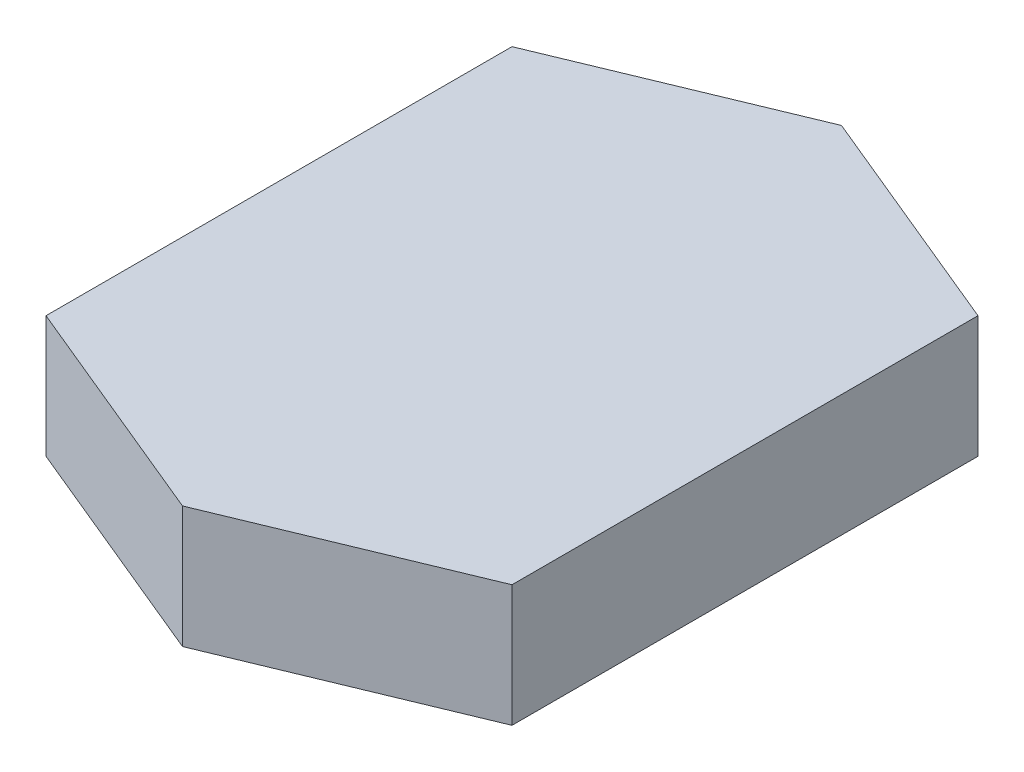
ISO-10303-21;
HEADER;
FILE_DESCRIPTION(('STEP AP214'),'2;1');
FILE_NAME('part.step','',(''),(''),'','','');
FILE_SCHEMA(('AUTOMOTIVE_DESIGN { 1 0 10303 214 1 1 1 1 }'));
ENDSEC;
DATA;
#1=APPLICATION_CONTEXT('core data for automotive mechanical design processes');
#2=APPLICATION_PROTOCOL_DEFINITION('international standard','automotive_design',2000,#1);
#3=PRODUCT_CONTEXT('',#1,'mechanical');
#4=PRODUCT('Part','Part','',(#3));
#5=PRODUCT_RELATED_PRODUCT_CATEGORY('part','',(#4));
#6=PRODUCT_DEFINITION_FORMATION('','',#4);
#7=PRODUCT_DEFINITION_CONTEXT('part definition',#1,'design');
#8=PRODUCT_DEFINITION('design','',#6,#7);
#9=PRODUCT_DEFINITION_SHAPE('','',#8);
#10=(LENGTH_UNIT() NAMED_UNIT(*) SI_UNIT(.MILLI.,.METRE.));
#11=(NAMED_UNIT(*) PLANE_ANGLE_UNIT() SI_UNIT($,.RADIAN.));
#12=(NAMED_UNIT(*) SI_UNIT($,.STERADIAN.) SOLID_ANGLE_UNIT());
#13=UNCERTAINTY_MEASURE_WITH_UNIT(LENGTH_MEASURE(1.E-05),#10,'distance_accuracy_value','');
#14=(GEOMETRIC_REPRESENTATION_CONTEXT(3) GLOBAL_UNCERTAINTY_ASSIGNED_CONTEXT((#13)) GLOBAL_UNIT_ASSIGNED_CONTEXT((#10,
#11,#12)) REPRESENTATION_CONTEXT('',''));
#15=CARTESIAN_POINT('',(0.,0.,0.));
#16=DIRECTION('',(0.,0.,1.));
#17=DIRECTION('',(1.,0.,0.));
#18=AXIS2_PLACEMENT_3D('',#15,#16,#17);
#19=CARTESIAN_POINT('',(-19.1341716182545,10.,-19.1341716182545));
#20=DIRECTION('',(0.382683432365091,0.,0.923879532511287));
#21=DIRECTION('',(0.923879532511287,0.,-0.382683432365091));
#22=AXIS2_PLACEMENT_3D('',#19,#20,#21);
#23=PLANE('',#22);
#24=DIRECTION('',(-0.923879532511287,0.,0.382683432365091));
#25=VECTOR('',#24,1.);
#26=CARTESIAN_POINT('',(-19.1341716182545,0.,-19.1341716182545));
#27=LINE('',#26,#25);
#28=CARTESIAN_POINT('',(0.,0.,-27.0598050073099));
#29=VERTEX_POINT('',#28);
#30=CARTESIAN_POINT('',(-19.1341716182545,0.,-19.1341716182545));
#31=VERTEX_POINT('',#30);
#32=EDGE_CURVE('E135',#29,#31,#27,.T.);
#33=ORIENTED_EDGE('',*,*,#32,.T.);
#34=DIRECTION('',(0.,-1.,0.));
#35=VECTOR('',#34,1.);
#36=CARTESIAN_POINT('',(-19.1341716182545,10.,-19.1341716182545));
#37=LINE('',#36,#35);
#38=CARTESIAN_POINT('',(-19.1341716182545,10.,-19.1341716182545));
#39=VERTEX_POINT('',#38);
#40=EDGE_CURVE('E12',#39,#31,#37,.T.);
#41=ORIENTED_EDGE('',*,*,#40,.F.);
#42=DIRECTION('',(-0.923879532511287,0.,0.382683432365091));
#43=VECTOR('',#42,1.);
#44=CARTESIAN_POINT('',(-19.1341716182545,10.,-19.1341716182545));
#45=LINE('',#44,#43);
#46=CARTESIAN_POINT('',(0.,10.,-27.0598050073099));
#47=VERTEX_POINT('',#46);
#48=EDGE_CURVE('E145',#47,#39,#45,.T.);
#49=ORIENTED_EDGE('',*,*,#48,.F.);
#50=DIRECTION('',(0.,-1.,0.));
#51=VECTOR('',#50,1.);
#52=CARTESIAN_POINT('',(0.,10.,-27.0598050073099));
#53=LINE('',#52,#51);
#54=EDGE_CURVE('E131',#47,#29,#53,.T.);
#55=ORIENTED_EDGE('',*,*,#54,.T.);
#56=EDGE_LOOP('',(#33,#41,#49,#55));
#57=FACE_BOUND('',#56,.T.);
#58=ADVANCED_FACE('F51',(#57),#23,.F.);
#59=CARTESIAN_POINT('',(-19.1341716182544,10.,19.1341716182545));
#60=DIRECTION('',(1.,0.,0.));
#61=DIRECTION('',(0.,0.,-1.));
#62=AXIS2_PLACEMENT_3D('',#59,#60,#61);
#63=PLANE('',#62);
#64=DIRECTION('',(0.,0.,1.));
#65=VECTOR('',#64,1.);
#66=CARTESIAN_POINT('',(-19.1341716182544,0.,19.1341716182545));
#67=LINE('',#66,#65);
#68=CARTESIAN_POINT('',(-19.1341716182544,0.,19.1341716182545));
#69=VERTEX_POINT('',#68);
#70=EDGE_CURVE('E138',#31,#69,#67,.T.);
#71=ORIENTED_EDGE('',*,*,#70,.T.);
#72=DIRECTION('',(0.,-1.,0.));
#73=VECTOR('',#72,1.);
#74=CARTESIAN_POINT('',(-19.1341716182544,10.,19.1341716182545));
#75=LINE('',#74,#73);
#76=CARTESIAN_POINT('',(-19.1341716182544,10.,19.1341716182545));
#77=VERTEX_POINT('',#76);
#78=EDGE_CURVE('E59',#77,#69,#75,.T.);
#79=ORIENTED_EDGE('',*,*,#78,.F.);
#80=DIRECTION('',(0.,0.,1.));
#81=VECTOR('',#80,1.);
#82=CARTESIAN_POINT('',(-19.1341716182544,10.,19.1341716182545));
#83=LINE('',#82,#81);
#84=EDGE_CURVE('E104',#39,#77,#83,.T.);
#85=ORIENTED_EDGE('',*,*,#84,.F.);
#86=ORIENTED_EDGE('',*,*,#40,.T.);
#87=EDGE_LOOP('',(#71,#79,#85,#86));
#88=FACE_BOUND('',#87,.T.);
#89=ADVANCED_FACE('F169',(#88),#63,.F.);
#90=CARTESIAN_POINT('',(0.,10.,27.0598050073098));
#91=DIRECTION('',(0.382683432365089,0.,-0.923879532511287));
#92=DIRECTION('',(-0.923879532511287,0.,-0.382683432365089));
#93=AXIS2_PLACEMENT_3D('',#90,#91,#92);
#94=PLANE('',#93);
#95=DIRECTION('',(0.923879532511287,0.,0.382683432365089));
#96=VECTOR('',#95,1.);
#97=CARTESIAN_POINT('',(0.,0.,27.0598050073098));
#98=LINE('',#97,#96);
#99=CARTESIAN_POINT('',(0.,0.,27.0598050073098));
#100=VERTEX_POINT('',#99);
#101=EDGE_CURVE('E140',#69,#100,#98,.T.);
#102=ORIENTED_EDGE('',*,*,#101,.T.);
#103=DIRECTION('',(0.,-1.,0.));
#104=VECTOR('',#103,1.);
#105=CARTESIAN_POINT('',(0.,10.,27.0598050073098));
#106=LINE('',#105,#104);
#107=CARTESIAN_POINT('',(0.,10.,27.0598050073098));
#108=VERTEX_POINT('',#107);
#109=EDGE_CURVE('E126',#108,#100,#106,.T.);
#110=ORIENTED_EDGE('',*,*,#109,.F.);
#111=DIRECTION('',(0.923879532511287,0.,0.382683432365089));
#112=VECTOR('',#111,1.);
#113=CARTESIAN_POINT('',(0.,10.,27.0598050073098));
#114=LINE('',#113,#112);
#115=EDGE_CURVE('E117',#77,#108,#114,.T.);
#116=ORIENTED_EDGE('',*,*,#115,.F.);
#117=ORIENTED_EDGE('',*,*,#78,.T.);
#118=EDGE_LOOP('',(#102,#110,#116,#117));
#119=FACE_BOUND('',#118,.T.);
#120=ADVANCED_FACE('F151',(#119),#94,.F.);
#121=CARTESIAN_POINT('',(19.1341716182545,10.,19.1341716182545));
#122=DIRECTION('',(-0.38268343236509,0.,-0.923879532511287));
#123=DIRECTION('',(-0.923879532511287,0.,0.38268343236509));
#124=AXIS2_PLACEMENT_3D('',#121,#122,#123);
#125=PLANE('',#124);
#126=DIRECTION('',(0.923879532511287,0.,-0.38268343236509));
#127=VECTOR('',#126,1.);
#128=CARTESIAN_POINT('',(19.1341716182545,0.,19.1341716182545));
#129=LINE('',#128,#127);
#130=CARTESIAN_POINT('',(19.1341716182545,0.,19.1341716182545));
#131=VERTEX_POINT('',#130);
#132=EDGE_CURVE('E125',#100,#131,#129,.T.);
#133=ORIENTED_EDGE('',*,*,#132,.T.);
#134=DIRECTION('',(0.,-1.,0.));
#135=VECTOR('',#134,1.);
#136=CARTESIAN_POINT('',(19.1341716182545,10.,19.1341716182545));
#137=LINE('',#136,#135);
#138=CARTESIAN_POINT('',(19.1341716182545,10.,19.1341716182545));
#139=VERTEX_POINT('',#138);
#140=EDGE_CURVE('E122',#139,#131,#137,.T.);
#141=ORIENTED_EDGE('',*,*,#140,.F.);
#142=DIRECTION('',(0.923879532511287,0.,-0.38268343236509));
#143=VECTOR('',#142,1.);
#144=CARTESIAN_POINT('',(19.1341716182545,10.,19.1341716182545));
#145=LINE('',#144,#143);
#146=EDGE_CURVE('E111',#108,#139,#145,.T.);
#147=ORIENTED_EDGE('',*,*,#146,.F.);
#148=ORIENTED_EDGE('',*,*,#109,.T.);
#149=EDGE_LOOP('',(#133,#141,#147,#148));
#150=FACE_BOUND('',#149,.T.);
#151=ADVANCED_FACE('F123',(#150),#125,.F.);
#152=CARTESIAN_POINT('',(19.1341716182545,10.,-19.1341716182545));
#153=DIRECTION('',(-1.,0.,0.));
#154=DIRECTION('',(0.,0.,1.));
#155=AXIS2_PLACEMENT_3D('',#152,#153,#154);
#156=PLANE('',#155);
#157=DIRECTION('',(0.,0.,-1.));
#158=VECTOR('',#157,1.);
#159=CARTESIAN_POINT('',(19.1341716182545,0.,-19.1341716182545));
#160=LINE('',#159,#158);
#161=CARTESIAN_POINT('',(19.1341716182545,0.,-19.1341716182545));
#162=VERTEX_POINT('',#161);
#163=EDGE_CURVE('E90',#131,#162,#160,.T.);
#164=ORIENTED_EDGE('',*,*,#163,.T.);
#165=DIRECTION('',(0.,-1.,0.));
#166=VECTOR('',#165,1.);
#167=CARTESIAN_POINT('',(19.1341716182545,10.,-19.1341716182545));
#168=LINE('',#167,#166);
#169=CARTESIAN_POINT('',(19.1341716182545,10.,-19.1341716182545));
#170=VERTEX_POINT('',#169);
#171=EDGE_CURVE('E127',#170,#162,#168,.T.);
#172=ORIENTED_EDGE('',*,*,#171,.F.);
#173=DIRECTION('',(0.,0.,-1.));
#174=VECTOR('',#173,1.);
#175=CARTESIAN_POINT('',(19.1341716182545,10.,-19.1341716182545));
#176=LINE('',#175,#174);
#177=EDGE_CURVE('E115',#139,#170,#176,.T.);
#178=ORIENTED_EDGE('',*,*,#177,.F.);
#179=ORIENTED_EDGE('',*,*,#140,.T.);
#180=EDGE_LOOP('',(#164,#172,#178,#179));
#181=FACE_BOUND('',#180,.T.);
#182=ADVANCED_FACE('F129',(#181),#156,.F.);
#183=CARTESIAN_POINT('',(0.,10.,-27.0598050073099));
#184=DIRECTION('',(-0.382683432365089,0.,0.923879532511287));
#185=DIRECTION('',(0.923879532511287,0.,0.382683432365089));
#186=AXIS2_PLACEMENT_3D('',#183,#184,#185);
#187=PLANE('',#186);
#188=DIRECTION('',(-0.923879532511287,0.,-0.382683432365089));
#189=VECTOR('',#188,1.);
#190=CARTESIAN_POINT('',(0.,0.,-27.0598050073099));
#191=LINE('',#190,#189);
#192=EDGE_CURVE('E96',#162,#29,#191,.T.);
#193=ORIENTED_EDGE('',*,*,#192,.T.);
#194=ORIENTED_EDGE('',*,*,#54,.F.);
#195=DIRECTION('',(-0.923879532511287,0.,-0.382683432365089));
#196=VECTOR('',#195,1.);
#197=CARTESIAN_POINT('',(0.,10.,-27.0598050073099));
#198=LINE('',#197,#196);
#199=EDGE_CURVE('E67',#170,#47,#198,.T.);
#200=ORIENTED_EDGE('',*,*,#199,.F.);
#201=ORIENTED_EDGE('',*,*,#171,.T.);
#202=EDGE_LOOP('',(#193,#194,#200,#201));
#203=FACE_BOUND('',#202,.T.);
#204=ADVANCED_FACE('F158',(#203),#187,.F.);
#205=CARTESIAN_POINT('',(0.,10.,0.));
#206=DIRECTION('',(0.,-1.,0.));
#207=DIRECTION('',(0.,0.,-1.));
#208=AXIS2_PLACEMENT_3D('',#205,#206,#207);
#209=PLANE('',#208);
#210=ORIENTED_EDGE('',*,*,#48,.T.);
#211=ORIENTED_EDGE('',*,*,#84,.T.);
#212=ORIENTED_EDGE('',*,*,#115,.T.);
#213=ORIENTED_EDGE('',*,*,#146,.T.);
#214=ORIENTED_EDGE('',*,*,#177,.T.);
#215=ORIENTED_EDGE('',*,*,#199,.T.);
#216=EDGE_LOOP('',(#210,#211,#212,#213,#214,#215));
#217=FACE_BOUND('',#216,.T.);
#218=ADVANCED_FACE('F113',(#217),#209,.F.);
#219=CARTESIAN_POINT('',(0.,0.,0.));
#220=DIRECTION('',(0.,-1.,0.));
#221=DIRECTION('',(0.,0.,-1.));
#222=AXIS2_PLACEMENT_3D('',#219,#220,#221);
#223=PLANE('',#222);
#224=ORIENTED_EDGE('',*,*,#32,.F.);
#225=ORIENTED_EDGE('',*,*,#192,.F.);
#226=ORIENTED_EDGE('',*,*,#163,.F.);
#227=ORIENTED_EDGE('',*,*,#132,.F.);
#228=ORIENTED_EDGE('',*,*,#101,.F.);
#229=ORIENTED_EDGE('',*,*,#70,.F.);
#230=EDGE_LOOP('',(#224,#225,#226,#227,#228,#229));
#231=FACE_BOUND('',#230,.T.);
#232=ADVANCED_FACE('F154',(#231),#223,.T.);
#233=CLOSED_SHELL('',(#58,#89,#120,#151,#182,#204,#218,#232));
#234=MANIFOLD_SOLID_BREP('B2',#233);
#235=CARTESIAN_POINT('',(-19.1341716182545,10.,-19.1341716182545));
#236=DIRECTION('',(0.382683432365091,0.,0.923879532511287));
#237=DIRECTION('',(0.923879532511287,0.,-0.382683432365091));
#238=AXIS2_PLACEMENT_3D('',#235,#236,#237);
#239=PLANE('',#238);
#240=DIRECTION('',(-0.923879532511287,0.,0.382683432365091));
#241=VECTOR('',#240,1.);
#242=CARTESIAN_POINT('',(-19.1341716182545,0.,-19.1341716182545));
#243=LINE('',#242,#241);
#244=CARTESIAN_POINT('',(0.,0.,-27.0598050073099));
#245=VERTEX_POINT('',#244);
#246=CARTESIAN_POINT('',(-19.1341716182545,0.,-19.1341716182545));
#247=VERTEX_POINT('',#246);
#248=EDGE_CURVE('E311',#245,#247,#243,.T.);
#249=ORIENTED_EDGE('',*,*,#248,.T.);
#250=DIRECTION('',(0.,-1.,0.));
#251=VECTOR('',#250,1.);
#252=CARTESIAN_POINT('',(-19.1341716182545,10.,-19.1341716182545));
#253=LINE('',#252,#251);
#254=CARTESIAN_POINT('',(-19.1341716182545,10.,-19.1341716182545));
#255=VERTEX_POINT('',#254);
#256=EDGE_CURVE('E49',#255,#247,#253,.T.);
#257=ORIENTED_EDGE('',*,*,#256,.F.);
#258=DIRECTION('',(-0.923879532511287,0.,0.382683432365091));
#259=VECTOR('',#258,1.);
#260=CARTESIAN_POINT('',(-19.1341716182545,10.,-19.1341716182545));
#261=LINE('',#260,#259);
#262=CARTESIAN_POINT('',(0.,10.,-27.0598050073099));
#263=VERTEX_POINT('',#262);
#264=EDGE_CURVE('E321',#263,#255,#261,.T.);
#265=ORIENTED_EDGE('',*,*,#264,.F.);
#266=DIRECTION('',(0.,-1.,0.));
#267=VECTOR('',#266,1.);
#268=CARTESIAN_POINT('',(0.,10.,-27.0598050073099));
#269=LINE('',#268,#267);
#270=EDGE_CURVE('E307',#263,#245,#269,.T.);
#271=ORIENTED_EDGE('',*,*,#270,.T.);
#272=EDGE_LOOP('',(#249,#257,#265,#271));
#273=FACE_BOUND('',#272,.T.);
#274=ADVANCED_FACE('F227',(#273),#239,.F.);
#275=CARTESIAN_POINT('',(-19.1341716182544,10.,19.1341716182545));
#276=DIRECTION('',(1.,0.,0.));
#277=DIRECTION('',(0.,0.,-1.));
#278=AXIS2_PLACEMENT_3D('',#275,#276,#277);
#279=PLANE('',#278);
#280=DIRECTION('',(0.,0.,1.));
#281=VECTOR('',#280,1.);
#282=CARTESIAN_POINT('',(-19.1341716182544,0.,19.1341716182545));
#283=LINE('',#282,#281);
#284=CARTESIAN_POINT('',(-19.1341716182544,0.,19.1341716182545));
#285=VERTEX_POINT('',#284);
#286=EDGE_CURVE('E314',#247,#285,#283,.T.);
#287=ORIENTED_EDGE('',*,*,#286,.T.);
#288=DIRECTION('',(0.,-1.,0.));
#289=VECTOR('',#288,1.);
#290=CARTESIAN_POINT('',(-19.1341716182544,10.,19.1341716182545));
#291=LINE('',#290,#289);
#292=CARTESIAN_POINT('',(-19.1341716182544,10.,19.1341716182545));
#293=VERTEX_POINT('',#292);
#294=EDGE_CURVE('E235',#293,#285,#291,.T.);
#295=ORIENTED_EDGE('',*,*,#294,.F.);
#296=DIRECTION('',(0.,0.,1.));
#297=VECTOR('',#296,1.);
#298=CARTESIAN_POINT('',(-19.1341716182544,10.,19.1341716182545));
#299=LINE('',#298,#297);
#300=EDGE_CURVE('E280',#255,#293,#299,.T.);
#301=ORIENTED_EDGE('',*,*,#300,.F.);
#302=ORIENTED_EDGE('',*,*,#256,.T.);
#303=EDGE_LOOP('',(#287,#295,#301,#302));
#304=FACE_BOUND('',#303,.T.);
#305=ADVANCED_FACE('F345',(#304),#279,.F.);
#306=CARTESIAN_POINT('',(0.,10.,27.0598050073098));
#307=DIRECTION('',(0.382683432365089,0.,-0.923879532511287));
#308=DIRECTION('',(-0.923879532511287,0.,-0.382683432365089));
#309=AXIS2_PLACEMENT_3D('',#306,#307,#308);
#310=PLANE('',#309);
#311=DIRECTION('',(0.923879532511287,0.,0.382683432365089));
#312=VECTOR('',#311,1.);
#313=CARTESIAN_POINT('',(0.,0.,27.0598050073098));
#314=LINE('',#313,#312);
#315=CARTESIAN_POINT('',(0.,0.,27.0598050073098));
#316=VERTEX_POINT('',#315);
#317=EDGE_CURVE('E316',#285,#316,#314,.T.);
#318=ORIENTED_EDGE('',*,*,#317,.T.);
#319=DIRECTION('',(0.,-1.,0.));
#320=VECTOR('',#319,1.);
#321=CARTESIAN_POINT('',(0.,10.,27.0598050073098));
#322=LINE('',#321,#320);
#323=CARTESIAN_POINT('',(0.,10.,27.0598050073098));
#324=VERTEX_POINT('',#323);
#325=EDGE_CURVE('E302',#324,#316,#322,.T.);
#326=ORIENTED_EDGE('',*,*,#325,.F.);
#327=DIRECTION('',(0.923879532511287,0.,0.382683432365089));
#328=VECTOR('',#327,1.);
#329=CARTESIAN_POINT('',(0.,10.,27.0598050073098));
#330=LINE('',#329,#328);
#331=EDGE_CURVE('E293',#293,#324,#330,.T.);
#332=ORIENTED_EDGE('',*,*,#331,.F.);
#333=ORIENTED_EDGE('',*,*,#294,.T.);
#334=EDGE_LOOP('',(#318,#326,#332,#333));
#335=FACE_BOUND('',#334,.T.);
#336=ADVANCED_FACE('F327',(#335),#310,.F.);
#337=CARTESIAN_POINT('',(19.1341716182545,10.,19.1341716182545));
#338=DIRECTION('',(-0.38268343236509,0.,-0.923879532511287));
#339=DIRECTION('',(-0.923879532511287,0.,0.38268343236509));
#340=AXIS2_PLACEMENT_3D('',#337,#338,#339);
#341=PLANE('',#340);
#342=DIRECTION('',(0.923879532511287,0.,-0.38268343236509));
#343=VECTOR('',#342,1.);
#344=CARTESIAN_POINT('',(19.1341716182545,0.,19.1341716182545));
#345=LINE('',#344,#343);
#346=CARTESIAN_POINT('',(19.1341716182545,0.,19.1341716182545));
#347=VERTEX_POINT('',#346);
#348=EDGE_CURVE('E301',#316,#347,#345,.T.);
#349=ORIENTED_EDGE('',*,*,#348,.T.);
#350=DIRECTION('',(0.,-1.,0.));
#351=VECTOR('',#350,1.);
#352=CARTESIAN_POINT('',(19.1341716182545,10.,19.1341716182545));
#353=LINE('',#352,#351);
#354=CARTESIAN_POINT('',(19.1341716182545,10.,19.1341716182545));
#355=VERTEX_POINT('',#354);
#356=EDGE_CURVE('E298',#355,#347,#353,.T.);
#357=ORIENTED_EDGE('',*,*,#356,.F.);
#358=DIRECTION('',(0.923879532511287,0.,-0.38268343236509));
#359=VECTOR('',#358,1.);
#360=CARTESIAN_POINT('',(19.1341716182545,10.,19.1341716182545));
#361=LINE('',#360,#359);
#362=EDGE_CURVE('E287',#324,#355,#361,.T.);
#363=ORIENTED_EDGE('',*,*,#362,.F.);
#364=ORIENTED_EDGE('',*,*,#325,.T.);
#365=EDGE_LOOP('',(#349,#357,#363,#364));
#366=FACE_BOUND('',#365,.T.);
#367=ADVANCED_FACE('F299',(#366),#341,.F.);
#368=CARTESIAN_POINT('',(19.1341716182545,10.,-19.1341716182545));
#369=DIRECTION('',(-1.,0.,0.));
#370=DIRECTION('',(0.,0.,1.));
#371=AXIS2_PLACEMENT_3D('',#368,#369,#370);
#372=PLANE('',#371);
#373=DIRECTION('',(0.,0.,-1.));
#374=VECTOR('',#373,1.);
#375=CARTESIAN_POINT('',(19.1341716182545,0.,-19.1341716182545));
#376=LINE('',#375,#374);
#377=CARTESIAN_POINT('',(19.1341716182545,0.,-19.1341716182545));
#378=VERTEX_POINT('',#377);
#379=EDGE_CURVE('E266',#347,#378,#376,.T.);
#380=ORIENTED_EDGE('',*,*,#379,.T.);
#381=DIRECTION('',(0.,-1.,0.));
#382=VECTOR('',#381,1.);
#383=CARTESIAN_POINT('',(19.1341716182545,10.,-19.1341716182545));
#384=LINE('',#383,#382);
#385=CARTESIAN_POINT('',(19.1341716182545,10.,-19.1341716182545));
#386=VERTEX_POINT('',#385);
#387=EDGE_CURVE('E303',#386,#378,#384,.T.);
#388=ORIENTED_EDGE('',*,*,#387,.F.);
#389=DIRECTION('',(0.,0.,-1.));
#390=VECTOR('',#389,1.);
#391=CARTESIAN_POINT('',(19.1341716182545,10.,-19.1341716182545));
#392=LINE('',#391,#390);
#393=EDGE_CURVE('E291',#355,#386,#392,.T.);
#394=ORIENTED_EDGE('',*,*,#393,.F.);
#395=ORIENTED_EDGE('',*,*,#356,.T.);
#396=EDGE_LOOP('',(#380,#388,#394,#395));
#397=FACE_BOUND('',#396,.T.);
#398=ADVANCED_FACE('F305',(#397),#372,.F.);
#399=CARTESIAN_POINT('',(0.,10.,-27.0598050073099));
#400=DIRECTION('',(-0.382683432365089,0.,0.923879532511287));
#401=DIRECTION('',(0.923879532511287,0.,0.382683432365089));
#402=AXIS2_PLACEMENT_3D('',#399,#400,#401);
#403=PLANE('',#402);
#404=DIRECTION('',(-0.923879532511287,0.,-0.382683432365089));
#405=VECTOR('',#404,1.);
#406=CARTESIAN_POINT('',(0.,0.,-27.0598050073099));
#407=LINE('',#406,#405);
#408=EDGE_CURVE('E272',#378,#245,#407,.T.);
#409=ORIENTED_EDGE('',*,*,#408,.T.);
#410=ORIENTED_EDGE('',*,*,#270,.F.);
#411=DIRECTION('',(-0.923879532511287,0.,-0.382683432365089));
#412=VECTOR('',#411,1.);
#413=CARTESIAN_POINT('',(0.,10.,-27.0598050073099));
#414=LINE('',#413,#412);
#415=EDGE_CURVE('E243',#386,#263,#414,.T.);
#416=ORIENTED_EDGE('',*,*,#415,.F.);
#417=ORIENTED_EDGE('',*,*,#387,.T.);
#418=EDGE_LOOP('',(#409,#410,#416,#417));
#419=FACE_BOUND('',#418,.T.);
#420=ADVANCED_FACE('F334',(#419),#403,.F.);
#421=CARTESIAN_POINT('',(0.,10.,0.));
#422=DIRECTION('',(0.,-1.,0.));
#423=DIRECTION('',(0.,0.,-1.));
#424=AXIS2_PLACEMENT_3D('',#421,#422,#423);
#425=PLANE('',#424);
#426=ORIENTED_EDGE('',*,*,#264,.T.);
#427=ORIENTED_EDGE('',*,*,#300,.T.);
#428=ORIENTED_EDGE('',*,*,#331,.T.);
#429=ORIENTED_EDGE('',*,*,#362,.T.);
#430=ORIENTED_EDGE('',*,*,#393,.T.);
#431=ORIENTED_EDGE('',*,*,#415,.T.);
#432=EDGE_LOOP('',(#426,#427,#428,#429,#430,#431));
#433=FACE_BOUND('',#432,.T.);
#434=ADVANCED_FACE('F289',(#433),#425,.F.);
#435=CARTESIAN_POINT('',(0.,0.,0.));
#436=DIRECTION('',(0.,-1.,0.));
#437=DIRECTION('',(0.,0.,-1.));
#438=AXIS2_PLACEMENT_3D('',#435,#436,#437);
#439=PLANE('',#438);
#440=ORIENTED_EDGE('',*,*,#248,.F.);
#441=ORIENTED_EDGE('',*,*,#408,.F.);
#442=ORIENTED_EDGE('',*,*,#379,.F.);
#443=ORIENTED_EDGE('',*,*,#348,.F.);
#444=ORIENTED_EDGE('',*,*,#317,.F.);
#445=ORIENTED_EDGE('',*,*,#286,.F.);
#446=EDGE_LOOP('',(#440,#441,#442,#443,#444,#445));
#447=FACE_BOUND('',#446,.T.);
#448=ADVANCED_FACE('F330',(#447),#439,.T.);
#449=CLOSED_SHELL('',(#274,#305,#336,#367,#398,#420,#434,#448));
#450=MANIFOLD_SOLID_BREP('B6',#449);
#451=ADVANCED_BREP_SHAPE_REPRESENTATION('',(#18,#234,#450),#14);
#452=SHAPE_DEFINITION_REPRESENTATION(#9,#451);
ENDSEC;
END-ISO-10303-21;
